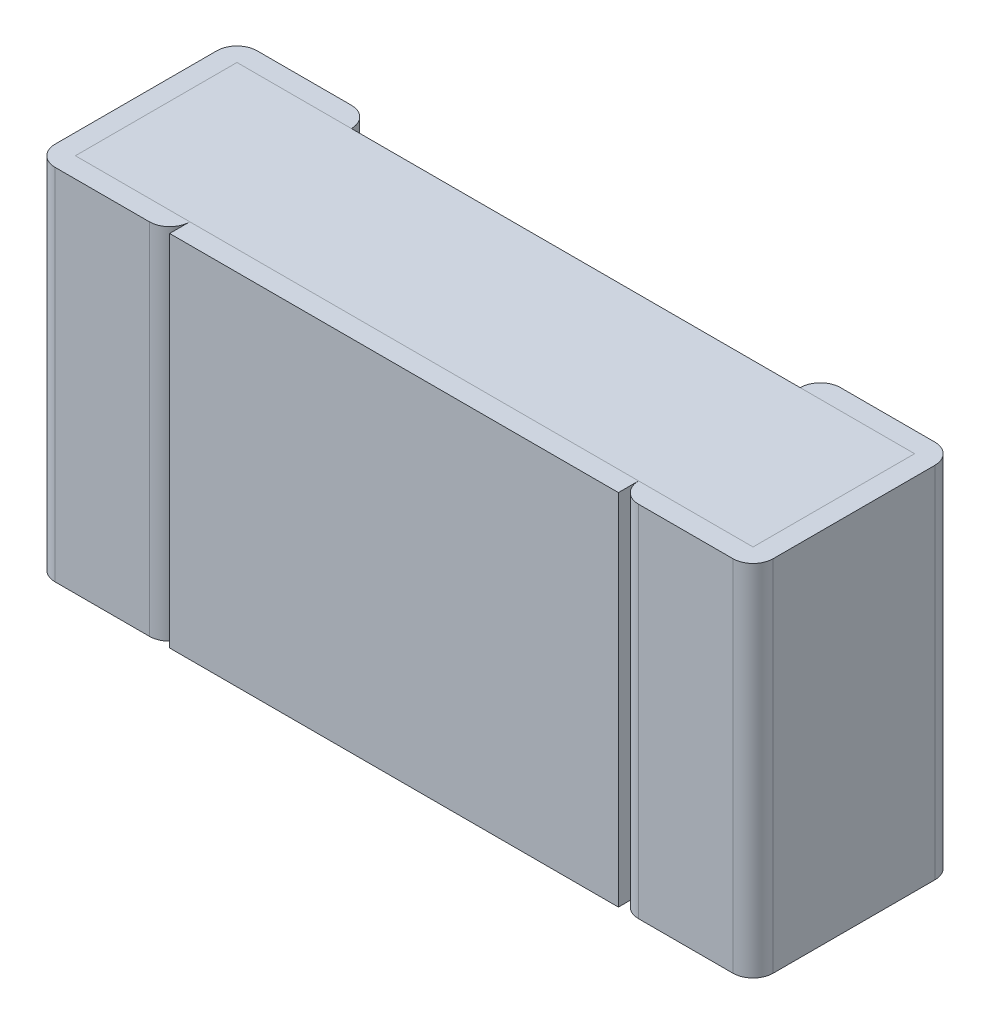
ISO-10303-21;
HEADER;
FILE_DESCRIPTION(('STEP AP214'),'2;1');
FILE_NAME('part.step','',(''),(''),'','','');
FILE_SCHEMA(('AUTOMOTIVE_DESIGN { 1 0 10303 214 1 1 1 1 }'));
ENDSEC;
DATA;
#1=APPLICATION_CONTEXT('core data for automotive mechanical design processes');
#2=APPLICATION_PROTOCOL_DEFINITION('international standard','automotive_design',2000,#1);
#3=PRODUCT_CONTEXT('',#1,'mechanical');
#4=PRODUCT('Part','Part','',(#3));
#5=PRODUCT_RELATED_PRODUCT_CATEGORY('part','',(#4));
#6=PRODUCT_DEFINITION_FORMATION('','',#4);
#7=PRODUCT_DEFINITION_CONTEXT('part definition',#1,'design');
#8=PRODUCT_DEFINITION('design','',#6,#7);
#9=PRODUCT_DEFINITION_SHAPE('','',#8);
#10=(LENGTH_UNIT() NAMED_UNIT(*) SI_UNIT(.MILLI.,.METRE.));
#11=(NAMED_UNIT(*) PLANE_ANGLE_UNIT() SI_UNIT($,.RADIAN.));
#12=(NAMED_UNIT(*) SI_UNIT($,.STERADIAN.) SOLID_ANGLE_UNIT());
#13=UNCERTAINTY_MEASURE_WITH_UNIT(LENGTH_MEASURE(1.E-05),#10,'distance_accuracy_value','');
#14=(GEOMETRIC_REPRESENTATION_CONTEXT(3) GLOBAL_UNCERTAINTY_ASSIGNED_CONTEXT((#13)) GLOBAL_UNIT_ASSIGNED_CONTEXT((#10,
#11,#12)) REPRESENTATION_CONTEXT('',''));
#15=CARTESIAN_POINT('',(0.,0.,0.));
#16=DIRECTION('',(0.,0.,1.));
#17=DIRECTION('',(1.,0.,0.));
#18=AXIS2_PLACEMENT_3D('',#15,#16,#17);
#19=CARTESIAN_POINT('',(-0.5,-0.4,0.45));
#20=DIRECTION('',(0.,0.,1.));
#21=DIRECTION('',(1.,0.,0.));
#22=AXIS2_PLACEMENT_3D('',#19,#20,#21);
#23=PLANE('',#22);
#24=DIRECTION('',(0.,1.,0.));
#25=VECTOR('',#24,1.);
#26=CARTESIAN_POINT('',(-0.5,-0.4,0.45));
#27=LINE('',#26,#25);
#28=CARTESIAN_POINT('',(-0.5,-0.4,0.45));
#29=VERTEX_POINT('',#28);
#30=CARTESIAN_POINT('',(-0.5,0.4,0.45));
#31=VERTEX_POINT('',#30);
#32=EDGE_CURVE('E313',#29,#31,#27,.T.);
#33=ORIENTED_EDGE('',*,*,#32,.F.);
#34=DIRECTION('',(1.,0.,0.));
#35=VECTOR('',#34,1.);
#36=CARTESIAN_POINT('',(-0.5,-0.4,0.45));
#37=LINE('',#36,#35);
#38=CARTESIAN_POINT('',(0.5,-0.4,0.45));
#39=VERTEX_POINT('',#38);
#40=EDGE_CURVE('E308',#29,#39,#37,.T.);
#41=ORIENTED_EDGE('',*,*,#40,.T.);
#42=DIRECTION('',(0.,1.,0.));
#43=VECTOR('',#42,1.);
#44=CARTESIAN_POINT('',(0.5,-0.4,0.45));
#45=LINE('',#44,#43);
#46=CARTESIAN_POINT('',(0.5,0.4,0.45));
#47=VERTEX_POINT('',#46);
#48=EDGE_CURVE('E10',#39,#47,#45,.T.);
#49=ORIENTED_EDGE('',*,*,#48,.T.);
#50=DIRECTION('',(1.,0.,0.));
#51=VECTOR('',#50,1.);
#52=CARTESIAN_POINT('',(-0.5,0.4,0.45));
#53=LINE('',#52,#51);
#54=EDGE_CURVE('E241',#31,#47,#53,.T.);
#55=ORIENTED_EDGE('',*,*,#54,.F.);
#56=EDGE_LOOP('',(#33,#41,#49,#55));
#57=FACE_BOUND('',#56,.T.);
#58=ADVANCED_FACE('F16',(#57),#23,.T.);
#59=CARTESIAN_POINT('',(0.5,-0.4,0.405));
#60=DIRECTION('',(1.,0.,0.));
#61=DIRECTION('',(0.,1.,0.));
#62=AXIS2_PLACEMENT_3D('',#59,#60,#61);
#63=PLANE('',#62);
#64=DIRECTION('',(0.,0.,1.));
#65=VECTOR('',#64,1.);
#66=CARTESIAN_POINT('',(0.5,-0.4,0.405));
#67=LINE('',#66,#65);
#68=CARTESIAN_POINT('',(0.5,-0.4,0.405));
#69=VERTEX_POINT('',#68);
#70=EDGE_CURVE('E304',#69,#39,#67,.T.);
#71=ORIENTED_EDGE('',*,*,#70,.F.);
#72=DIRECTION('',(0.,1.,0.));
#73=VECTOR('',#72,1.);
#74=CARTESIAN_POINT('',(0.5,-0.4,0.405));
#75=LINE('',#74,#73);
#76=CARTESIAN_POINT('',(0.5,0.4,0.405));
#77=VERTEX_POINT('',#76);
#78=EDGE_CURVE('E27',#69,#77,#75,.T.);
#79=ORIENTED_EDGE('',*,*,#78,.T.);
#80=DIRECTION('',(0.,0.,1.));
#81=VECTOR('',#80,1.);
#82=CARTESIAN_POINT('',(0.5,0.4,0.405));
#83=LINE('',#82,#81);
#84=EDGE_CURVE('E245',#77,#47,#83,.T.);
#85=ORIENTED_EDGE('',*,*,#84,.T.);
#86=ORIENTED_EDGE('',*,*,#48,.F.);
#87=EDGE_LOOP('',(#71,#79,#85,#86));
#88=FACE_BOUND('',#87,.T.);
#89=ADVANCED_FACE('F501',(#88),#63,.T.);
#90=CARTESIAN_POINT('',(0.545,-0.4,0.405));
#91=DIRECTION('',(0.,1.,0.));
#92=DIRECTION('',(-1.,0.,0.));
#93=AXIS2_PLACEMENT_3D('',#90,#91,#92);
#94=CYLINDRICAL_SURFACE('',#93,0.045);
#95=CARTESIAN_POINT('',(0.545,-0.4,0.405));
#96=DIRECTION('',(0.,1.,0.));
#97=DIRECTION('',(0.,0.,1.));
#98=AXIS2_PLACEMENT_3D('',#95,#96,#97);
#99=CIRCLE('',#98,0.045);
#100=CARTESIAN_POINT('',(0.545,-0.4,0.45));
#101=VERTEX_POINT('',#100);
#102=EDGE_CURVE('E265',#69,#101,#99,.T.);
#103=ORIENTED_EDGE('',*,*,#102,.T.);
#104=DIRECTION('',(0.,1.,0.));
#105=VECTOR('',#104,1.);
#106=CARTESIAN_POINT('',(0.545,-0.4,0.45));
#107=LINE('',#106,#105);
#108=CARTESIAN_POINT('',(0.545,0.4,0.45));
#109=VERTEX_POINT('',#108);
#110=EDGE_CURVE('E341',#101,#109,#107,.T.);
#111=ORIENTED_EDGE('',*,*,#110,.T.);
#112=CARTESIAN_POINT('',(0.545,0.4,0.405));
#113=DIRECTION('',(0.,1.,0.));
#114=DIRECTION('',(0.,0.,1.));
#115=AXIS2_PLACEMENT_3D('',#112,#113,#114);
#116=CIRCLE('',#115,0.045);
#117=EDGE_CURVE('E228',#77,#109,#116,.T.);
#118=ORIENTED_EDGE('',*,*,#117,.F.);
#119=ORIENTED_EDGE('',*,*,#78,.F.);
#120=EDGE_LOOP('',(#103,#111,#118,#119));
#121=FACE_BOUND('',#120,.T.);
#122=ADVANCED_FACE('F510',(#121),#94,.T.);
#123=CARTESIAN_POINT('',(0.5,-0.4,0.45));
#124=DIRECTION('',(0.,0.,1.));
#125=DIRECTION('',(1.,0.,0.));
#126=AXIS2_PLACEMENT_3D('',#123,#124,#125);
#127=PLANE('',#126);
#128=DIRECTION('',(1.,0.,0.));
#129=VECTOR('',#128,1.);
#130=CARTESIAN_POINT('',(0.5,0.4,0.45));
#131=LINE('',#130,#129);
#132=CARTESIAN_POINT('',(0.755,0.4,0.45));
#133=VERTEX_POINT('',#132);
#134=EDGE_CURVE('E232',#109,#133,#131,.T.);
#135=ORIENTED_EDGE('',*,*,#134,.F.);
#136=ORIENTED_EDGE('',*,*,#110,.F.);
#137=DIRECTION('',(1.,0.,0.));
#138=VECTOR('',#137,1.);
#139=CARTESIAN_POINT('',(0.5,-0.4,0.45));
#140=LINE('',#139,#138);
#141=CARTESIAN_POINT('',(0.755,-0.4,0.45));
#142=VERTEX_POINT('',#141);
#143=EDGE_CURVE('E270',#101,#142,#140,.T.);
#144=ORIENTED_EDGE('',*,*,#143,.T.);
#145=DIRECTION('',(0.,1.,0.));
#146=VECTOR('',#145,1.);
#147=CARTESIAN_POINT('',(0.755,-0.4,0.45));
#148=LINE('',#147,#146);
#149=EDGE_CURVE('E344',#142,#133,#148,.T.);
#150=ORIENTED_EDGE('',*,*,#149,.T.);
#151=EDGE_LOOP('',(#135,#136,#144,#150));
#152=FACE_BOUND('',#151,.T.);
#153=ADVANCED_FACE('F619',(#152),#127,.T.);
#154=CARTESIAN_POINT('',(0.755,-0.4,0.405));
#155=DIRECTION('',(0.,1.,0.));
#156=DIRECTION('',(1.,0.,0.));
#157=AXIS2_PLACEMENT_3D('',#154,#155,#156);
#158=CYLINDRICAL_SURFACE('',#157,0.045);
#159=DIRECTION('',(0.,1.,0.));
#160=VECTOR('',#159,1.);
#161=CARTESIAN_POINT('',(0.8,-0.4,0.405));
#162=LINE('',#161,#160);
#163=CARTESIAN_POINT('',(0.8,-0.4,0.405));
#164=VERTEX_POINT('',#163);
#165=CARTESIAN_POINT('',(0.8,0.4,0.405));
#166=VERTEX_POINT('',#165);
#167=EDGE_CURVE('E380',#164,#166,#162,.T.);
#168=ORIENTED_EDGE('',*,*,#167,.T.);
#169=CARTESIAN_POINT('',(0.755,0.4,0.405));
#170=DIRECTION('',(0.,-1.,0.));
#171=DIRECTION('',(0.,0.,1.));
#172=AXIS2_PLACEMENT_3D('',#169,#170,#171);
#173=CIRCLE('',#172,0.045);
#174=EDGE_CURVE('E322',#166,#133,#173,.T.);
#175=ORIENTED_EDGE('',*,*,#174,.T.);
#176=ORIENTED_EDGE('',*,*,#149,.F.);
#177=CARTESIAN_POINT('',(0.755,-0.4,0.405));
#178=DIRECTION('',(0.,-1.,0.));
#179=DIRECTION('',(0.,0.,1.));
#180=AXIS2_PLACEMENT_3D('',#177,#178,#179);
#181=CIRCLE('',#180,0.045);
#182=EDGE_CURVE('E301',#164,#142,#181,.T.);
#183=ORIENTED_EDGE('',*,*,#182,.F.);
#184=EDGE_LOOP('',(#168,#175,#176,#183));
#185=FACE_BOUND('',#184,.T.);
#186=ADVANCED_FACE('F614',(#185),#158,.T.);
#187=CARTESIAN_POINT('',(0.8,-0.4,0.));
#188=DIRECTION('',(1.,0.,0.));
#189=DIRECTION('',(0.,1.,0.));
#190=AXIS2_PLACEMENT_3D('',#187,#188,#189);
#191=PLANE('',#190);
#192=DIRECTION('',(0.,0.,1.));
#193=VECTOR('',#192,1.);
#194=CARTESIAN_POINT('',(0.8,-0.4,0.));
#195=LINE('',#194,#193);
#196=CARTESIAN_POINT('',(0.8,-0.4,0.045));
#197=VERTEX_POINT('',#196);
#198=EDGE_CURVE('E258',#197,#164,#195,.T.);
#199=ORIENTED_EDGE('',*,*,#198,.F.);
#200=DIRECTION('',(0.,1.,0.));
#201=VECTOR('',#200,1.);
#202=CARTESIAN_POINT('',(0.8,-0.4,0.045));
#203=LINE('',#202,#201);
#204=CARTESIAN_POINT('',(0.8,0.4,0.045));
#205=VERTEX_POINT('',#204);
#206=EDGE_CURVE('E196',#197,#205,#203,.T.);
#207=ORIENTED_EDGE('',*,*,#206,.T.);
#208=DIRECTION('',(0.,0.,1.));
#209=VECTOR('',#208,1.);
#210=CARTESIAN_POINT('',(0.8,0.4,0.));
#211=LINE('',#210,#209);
#212=EDGE_CURVE('E318',#205,#166,#211,.T.);
#213=ORIENTED_EDGE('',*,*,#212,.T.);
#214=ORIENTED_EDGE('',*,*,#167,.F.);
#215=EDGE_LOOP('',(#199,#207,#213,#214));
#216=FACE_BOUND('',#215,.T.);
#217=ADVANCED_FACE('F18',(#216),#191,.T.);
#218=CARTESIAN_POINT('',(0.755,-0.4,0.045));
#219=DIRECTION('',(0.,1.,0.));
#220=DIRECTION('',(1.,0.,0.));
#221=AXIS2_PLACEMENT_3D('',#218,#219,#220);
#222=CYLINDRICAL_SURFACE('',#221,0.045);
#223=CARTESIAN_POINT('',(0.755,-0.4,0.045));
#224=DIRECTION('',(0.,1.,0.));
#225=DIRECTION('',(0.,0.,1.));
#226=AXIS2_PLACEMENT_3D('',#223,#224,#225);
#227=CIRCLE('',#226,0.045);
#228=CARTESIAN_POINT('',(0.755,-0.4,0.));
#229=VERTEX_POINT('',#228);
#230=EDGE_CURVE('E254',#197,#229,#227,.T.);
#231=ORIENTED_EDGE('',*,*,#230,.T.);
#232=DIRECTION('',(0.,1.,0.));
#233=VECTOR('',#232,1.);
#234=CARTESIAN_POINT('',(0.755,-0.4,0.));
#235=LINE('',#234,#233);
#236=CARTESIAN_POINT('',(0.755,0.4,0.));
#237=VERTEX_POINT('',#236);
#238=EDGE_CURVE('E377',#229,#237,#235,.T.);
#239=ORIENTED_EDGE('',*,*,#238,.T.);
#240=CARTESIAN_POINT('',(0.755,0.4,0.045));
#241=DIRECTION('',(0.,1.,0.));
#242=DIRECTION('',(0.,0.,1.));
#243=AXIS2_PLACEMENT_3D('',#240,#241,#242);
#244=CIRCLE('',#243,0.045);
#245=EDGE_CURVE('E246',#205,#237,#244,.T.);
#246=ORIENTED_EDGE('',*,*,#245,.F.);
#247=ORIENTED_EDGE('',*,*,#206,.F.);
#248=EDGE_LOOP('',(#231,#239,#246,#247));
#249=FACE_BOUND('',#248,.T.);
#250=ADVANCED_FACE('F594',(#249),#222,.T.);
#251=CARTESIAN_POINT('',(0.5,-0.4,0.));
#252=DIRECTION('',(0.,0.,1.));
#253=DIRECTION('',(1.,0.,0.));
#254=AXIS2_PLACEMENT_3D('',#251,#252,#253);
#255=PLANE('',#254);
#256=ORIENTED_EDGE('',*,*,#238,.F.);
#257=DIRECTION('',(1.,0.,0.));
#258=VECTOR('',#257,1.);
#259=CARTESIAN_POINT('',(0.5,-0.4,0.));
#260=LINE('',#259,#258);
#261=CARTESIAN_POINT('',(0.545,-0.4,0.));
#262=VERTEX_POINT('',#261);
#263=EDGE_CURVE('E309',#262,#229,#260,.T.);
#264=ORIENTED_EDGE('',*,*,#263,.F.);
#265=DIRECTION('',(0.,1.,0.));
#266=VECTOR('',#265,1.);
#267=CARTESIAN_POINT('',(0.545,-0.4,0.));
#268=LINE('',#267,#266);
#269=CARTESIAN_POINT('',(0.545,0.4,0.));
#270=VERTEX_POINT('',#269);
#271=EDGE_CURVE('E363',#262,#270,#268,.T.);
#272=ORIENTED_EDGE('',*,*,#271,.T.);
#273=DIRECTION('',(1.,0.,0.));
#274=VECTOR('',#273,1.);
#275=CARTESIAN_POINT('',(0.5,0.4,0.));
#276=LINE('',#275,#274);
#277=EDGE_CURVE('E249',#270,#237,#276,.T.);
#278=ORIENTED_EDGE('',*,*,#277,.T.);
#279=EDGE_LOOP('',(#256,#264,#272,#278));
#280=FACE_BOUND('',#279,.T.);
#281=ADVANCED_FACE('F586',(#280),#255,.F.);
#282=CARTESIAN_POINT('',(0.545,-0.4,0.045));
#283=DIRECTION('',(0.,1.,0.));
#284=DIRECTION('',(-1.,0.,0.));
#285=AXIS2_PLACEMENT_3D('',#282,#283,#284);
#286=CYLINDRICAL_SURFACE('',#285,0.045);
#287=DIRECTION('',(0.,1.,0.));
#288=VECTOR('',#287,1.);
#289=CARTESIAN_POINT('',(0.5,-0.4,0.045));
#290=LINE('',#289,#288);
#291=CARTESIAN_POINT('',(0.5,-0.4,0.045));
#292=VERTEX_POINT('',#291);
#293=CARTESIAN_POINT('',(0.5,0.4,0.045));
#294=VERTEX_POINT('',#293);
#295=EDGE_CURVE('E226',#292,#294,#290,.T.);
#296=ORIENTED_EDGE('',*,*,#295,.T.);
#297=CARTESIAN_POINT('',(0.545,0.4,0.045));
#298=DIRECTION('',(0.,-1.,0.));
#299=DIRECTION('',(0.,0.,1.));
#300=AXIS2_PLACEMENT_3D('',#297,#298,#299);
#301=CIRCLE('',#300,0.045);
#302=EDGE_CURVE('E233',#294,#270,#301,.T.);
#303=ORIENTED_EDGE('',*,*,#302,.T.);
#304=ORIENTED_EDGE('',*,*,#271,.F.);
#305=CARTESIAN_POINT('',(0.545,-0.4,0.045));
#306=DIRECTION('',(0.,-1.,0.));
#307=DIRECTION('',(0.,0.,1.));
#308=AXIS2_PLACEMENT_3D('',#305,#306,#307);
#309=CIRCLE('',#308,0.045);
#310=EDGE_CURVE('E269',#292,#262,#309,.T.);
#311=ORIENTED_EDGE('',*,*,#310,.F.);
#312=EDGE_LOOP('',(#296,#303,#304,#311));
#313=FACE_BOUND('',#312,.T.);
#314=ADVANCED_FACE('F581',(#313),#286,.T.);
#315=CARTESIAN_POINT('',(-0.5,0.4,0.405));
#316=DIRECTION('',(0.,1.,0.));
#317=DIRECTION('',(1.,0.,0.));
#318=AXIS2_PLACEMENT_3D('',#315,#316,#317);
#319=PLANE('',#318);
#320=DIRECTION('',(1.,0.,0.));
#321=VECTOR('',#320,1.);
#322=CARTESIAN_POINT('',(-0.5,0.4,0.405));
#323=LINE('',#322,#321);
#324=CARTESIAN_POINT('',(-0.5,0.4,0.405));
#325=VERTEX_POINT('',#324);
#326=EDGE_CURVE('E20',#325,#77,#323,.T.);
#327=ORIENTED_EDGE('',*,*,#326,.F.);
#328=DIRECTION('',(0.,0.,1.));
#329=VECTOR('',#328,1.);
#330=CARTESIAN_POINT('',(-0.5,0.4,0.405));
#331=LINE('',#330,#329);
#332=EDGE_CURVE('E253',#325,#31,#331,.T.);
#333=ORIENTED_EDGE('',*,*,#332,.T.);
#334=ORIENTED_EDGE('',*,*,#54,.T.);
#335=ORIENTED_EDGE('',*,*,#84,.F.);
#336=EDGE_LOOP('',(#327,#333,#334,#335));
#337=FACE_BOUND('',#336,.T.);
#338=ADVANCED_FACE('F507',(#337),#319,.T.);
#339=CARTESIAN_POINT('',(0.5,0.4,0.));
#340=DIRECTION('',(0.,1.,0.));
#341=DIRECTION('',(1.,0.,0.));
#342=AXIS2_PLACEMENT_3D('',#339,#340,#341);
#343=PLANE('',#342);
#344=ORIENTED_EDGE('',*,*,#277,.F.);
#345=ORIENTED_EDGE('',*,*,#302,.F.);
#346=DIRECTION('',(1.,0.,0.));
#347=VECTOR('',#346,1.);
#348=CARTESIAN_POINT('',(-0.755,0.4,0.045));
#349=LINE('',#348,#347);
#350=CARTESIAN_POINT('',(0.755,0.4,0.045));
#351=VERTEX_POINT('',#350);
#352=EDGE_CURVE('E227',#294,#351,#349,.T.);
#353=ORIENTED_EDGE('',*,*,#352,.T.);
#354=DIRECTION('',(0.,0.,1.));
#355=VECTOR('',#354,1.);
#356=CARTESIAN_POINT('',(0.755,0.4,0.045));
#357=LINE('',#356,#355);
#358=CARTESIAN_POINT('',(0.755,0.4,0.405));
#359=VERTEX_POINT('',#358);
#360=EDGE_CURVE('E330',#351,#359,#357,.T.);
#361=ORIENTED_EDGE('',*,*,#360,.T.);
#362=DIRECTION('',(1.,0.,0.));
#363=VECTOR('',#362,1.);
#364=CARTESIAN_POINT('',(-0.755,0.4,0.405));
#365=LINE('',#364,#363);
#366=EDGE_CURVE('E326',#77,#359,#365,.T.);
#367=ORIENTED_EDGE('',*,*,#366,.F.);
#368=ORIENTED_EDGE('',*,*,#117,.T.);
#369=ORIENTED_EDGE('',*,*,#134,.T.);
#370=ORIENTED_EDGE('',*,*,#174,.F.);
#371=ORIENTED_EDGE('',*,*,#212,.F.);
#372=ORIENTED_EDGE('',*,*,#245,.T.);
#373=EDGE_LOOP('',(#344,#345,#353,#361,#367,#368,#369,#370,#371,#372));
#374=FACE_BOUND('',#373,.T.);
#375=ADVANCED_FACE('F514',(#374),#343,.T.);
#376=CARTESIAN_POINT('',(-0.5,-0.4,0.405));
#377=DIRECTION('',(1.,0.,0.));
#378=DIRECTION('',(0.,1.,0.));
#379=AXIS2_PLACEMENT_3D('',#376,#377,#378);
#380=PLANE('',#379);
#381=ORIENTED_EDGE('',*,*,#32,.T.);
#382=ORIENTED_EDGE('',*,*,#332,.F.);
#383=DIRECTION('',(0.,1.,0.));
#384=VECTOR('',#383,1.);
#385=CARTESIAN_POINT('',(-0.5,-0.4,0.405));
#386=LINE('',#385,#384);
#387=CARTESIAN_POINT('',(-0.5,-0.4,0.405));
#388=VERTEX_POINT('',#387);
#389=EDGE_CURVE('E166',#388,#325,#386,.T.);
#390=ORIENTED_EDGE('',*,*,#389,.F.);
#391=DIRECTION('',(0.,0.,1.));
#392=VECTOR('',#391,1.);
#393=CARTESIAN_POINT('',(-0.5,-0.4,0.405));
#394=LINE('',#393,#392);
#395=EDGE_CURVE('E317',#388,#29,#394,.T.);
#396=ORIENTED_EDGE('',*,*,#395,.T.);
#397=EDGE_LOOP('',(#381,#382,#390,#396));
#398=FACE_BOUND('',#397,.T.);
#399=ADVANCED_FACE('F683',(#398),#380,.F.);
#400=CARTESIAN_POINT('',(-0.5,-0.4,0.405));
#401=DIRECTION('',(0.,1.,0.));
#402=DIRECTION('',(1.,0.,0.));
#403=AXIS2_PLACEMENT_3D('',#400,#401,#402);
#404=PLANE('',#403);
#405=ORIENTED_EDGE('',*,*,#70,.T.);
#406=ORIENTED_EDGE('',*,*,#40,.F.);
#407=ORIENTED_EDGE('',*,*,#395,.F.);
#408=DIRECTION('',(1.,0.,0.));
#409=VECTOR('',#408,1.);
#410=CARTESIAN_POINT('',(-0.5,-0.4,0.405));
#411=LINE('',#410,#409);
#412=EDGE_CURVE('E167',#388,#69,#411,.T.);
#413=ORIENTED_EDGE('',*,*,#412,.T.);
#414=EDGE_LOOP('',(#405,#406,#407,#413));
#415=FACE_BOUND('',#414,.T.);
#416=ADVANCED_FACE('F688',(#415),#404,.F.);
#417=CARTESIAN_POINT('',(0.5,-0.4,0.));
#418=DIRECTION('',(0.,1.,0.));
#419=DIRECTION('',(1.,0.,0.));
#420=AXIS2_PLACEMENT_3D('',#417,#418,#419);
#421=PLANE('',#420);
#422=ORIENTED_EDGE('',*,*,#230,.F.);
#423=ORIENTED_EDGE('',*,*,#198,.T.);
#424=ORIENTED_EDGE('',*,*,#182,.T.);
#425=ORIENTED_EDGE('',*,*,#143,.F.);
#426=ORIENTED_EDGE('',*,*,#102,.F.);
#427=DIRECTION('',(1.,0.,0.));
#428=VECTOR('',#427,1.);
#429=CARTESIAN_POINT('',(-0.755,-0.4,0.405));
#430=LINE('',#429,#428);
#431=CARTESIAN_POINT('',(0.755,-0.4,0.405));
#432=VERTEX_POINT('',#431);
#433=EDGE_CURVE('E334',#69,#432,#430,.T.);
#434=ORIENTED_EDGE('',*,*,#433,.T.);
#435=DIRECTION('',(0.,0.,1.));
#436=VECTOR('',#435,1.);
#437=CARTESIAN_POINT('',(0.755,-0.4,0.045));
#438=LINE('',#437,#436);
#439=CARTESIAN_POINT('',(0.755,-0.4,0.045));
#440=VERTEX_POINT('',#439);
#441=EDGE_CURVE('E278',#440,#432,#438,.T.);
#442=ORIENTED_EDGE('',*,*,#441,.F.);
#443=DIRECTION('',(1.,0.,0.));
#444=VECTOR('',#443,1.);
#445=CARTESIAN_POINT('',(-0.755,-0.4,0.045));
#446=LINE('',#445,#444);
#447=EDGE_CURVE('E275',#292,#440,#446,.T.);
#448=ORIENTED_EDGE('',*,*,#447,.F.);
#449=ORIENTED_EDGE('',*,*,#310,.T.);
#450=ORIENTED_EDGE('',*,*,#263,.T.);
#451=EDGE_LOOP('',(#422,#423,#424,#425,#426,#434,#442,#448,#449,#450));
#452=FACE_BOUND('',#451,.T.);
#453=ADVANCED_FACE('F608',(#452),#421,.F.);
#454=CARTESIAN_POINT('',(-0.755,-0.4,0.045));
#455=DIRECTION('',(0.,0.,1.));
#456=DIRECTION('',(1.,0.,0.));
#457=AXIS2_PLACEMENT_3D('',#454,#455,#456);
#458=PLANE('',#457);
#459=DIRECTION('',(1.,0.,0.));
#460=VECTOR('',#459,1.);
#461=CARTESIAN_POINT('',(-0.755,0.4,0.045));
#462=LINE('',#461,#460);
#463=CARTESIAN_POINT('',(-0.5,0.4,0.045));
#464=VERTEX_POINT('',#463);
#465=EDGE_CURVE('E222',#464,#294,#462,.T.);
#466=ORIENTED_EDGE('',*,*,#465,.T.);
#467=ORIENTED_EDGE('',*,*,#295,.F.);
#468=DIRECTION('',(1.,0.,0.));
#469=VECTOR('',#468,1.);
#470=CARTESIAN_POINT('',(-0.755,-0.4,0.045));
#471=LINE('',#470,#469);
#472=CARTESIAN_POINT('',(-0.5,-0.4,0.045));
#473=VERTEX_POINT('',#472);
#474=EDGE_CURVE('E279',#473,#292,#471,.T.);
#475=ORIENTED_EDGE('',*,*,#474,.F.);
#476=DIRECTION('',(0.,1.,0.));
#477=VECTOR('',#476,1.);
#478=CARTESIAN_POINT('',(-0.5,-0.4,0.045));
#479=LINE('',#478,#477);
#480=EDGE_CURVE('E299',#473,#464,#479,.T.);
#481=ORIENTED_EDGE('',*,*,#480,.T.);
#482=EDGE_LOOP('',(#466,#467,#475,#481));
#483=FACE_BOUND('',#482,.T.);
#484=ADVANCED_FACE('F535',(#483),#458,.F.);
#485=CARTESIAN_POINT('',(-0.755,0.4,0.045));
#486=DIRECTION('',(0.,1.,0.));
#487=DIRECTION('',(1.,0.,0.));
#488=AXIS2_PLACEMENT_3D('',#485,#486,#487);
#489=PLANE('',#488);
#490=DIRECTION('',(1.,0.,0.));
#491=VECTOR('',#490,1.);
#492=CARTESIAN_POINT('',(-0.755,0.4,0.045));
#493=LINE('',#492,#491);
#494=CARTESIAN_POINT('',(-0.755,0.4,0.045));
#495=VERTEX_POINT('',#494);
#496=EDGE_CURVE('E274',#495,#464,#493,.T.);
#497=ORIENTED_EDGE('',*,*,#496,.F.);
#498=DIRECTION('',(0.,0.,1.));
#499=VECTOR('',#498,1.);
#500=CARTESIAN_POINT('',(-0.755,0.4,0.045));
#501=LINE('',#500,#499);
#502=CARTESIAN_POINT('',(-0.755,0.4,0.405));
#503=VERTEX_POINT('',#502);
#504=EDGE_CURVE('E218',#495,#503,#501,.T.);
#505=ORIENTED_EDGE('',*,*,#504,.T.);
#506=DIRECTION('',(1.,0.,0.));
#507=VECTOR('',#506,1.);
#508=CARTESIAN_POINT('',(-0.755,0.4,0.405));
#509=LINE('',#508,#507);
#510=EDGE_CURVE('E177',#503,#325,#509,.T.);
#511=ORIENTED_EDGE('',*,*,#510,.T.);
#512=ORIENTED_EDGE('',*,*,#326,.T.);
#513=ORIENTED_EDGE('',*,*,#366,.T.);
#514=ORIENTED_EDGE('',*,*,#360,.F.);
#515=ORIENTED_EDGE('',*,*,#352,.F.);
#516=ORIENTED_EDGE('',*,*,#465,.F.);
#517=EDGE_LOOP('',(#497,#505,#511,#512,#513,#514,#515,#516));
#518=FACE_BOUND('',#517,.T.);
#519=ADVANCED_FACE('F407',(#518),#489,.T.);
#520=CARTESIAN_POINT('',(-0.545,-0.4,0.405));
#521=DIRECTION('',(0.,1.,0.));
#522=DIRECTION('',(1.,0.,0.));
#523=AXIS2_PLACEMENT_3D('',#520,#521,#522);
#524=CYLINDRICAL_SURFACE('',#523,0.045);
#525=ORIENTED_EDGE('',*,*,#389,.T.);
#526=CARTESIAN_POINT('',(-0.545,0.4,0.405));
#527=DIRECTION('',(0.,-1.,0.));
#528=DIRECTION('',(0.,0.,1.));
#529=AXIS2_PLACEMENT_3D('',#526,#527,#528);
#530=CIRCLE('',#529,0.045);
#531=CARTESIAN_POINT('',(-0.545,0.4,0.45));
#532=VERTEX_POINT('',#531);
#533=EDGE_CURVE('E170',#325,#532,#530,.T.);
#534=ORIENTED_EDGE('',*,*,#533,.T.);
#535=DIRECTION('',(0.,1.,0.));
#536=VECTOR('',#535,1.);
#537=CARTESIAN_POINT('',(-0.545,-0.4,0.45));
#538=LINE('',#537,#536);
#539=CARTESIAN_POINT('',(-0.545,-0.4,0.45));
#540=VERTEX_POINT('',#539);
#541=EDGE_CURVE('E154',#540,#532,#538,.T.);
#542=ORIENTED_EDGE('',*,*,#541,.F.);
#543=CARTESIAN_POINT('',(-0.545,-0.4,0.405));
#544=DIRECTION('',(0.,-1.,0.));
#545=DIRECTION('',(0.,0.,1.));
#546=AXIS2_PLACEMENT_3D('',#543,#544,#545);
#547=CIRCLE('',#546,0.045);
#548=EDGE_CURVE('E290',#388,#540,#547,.T.);
#549=ORIENTED_EDGE('',*,*,#548,.F.);
#550=EDGE_LOOP('',(#525,#534,#542,#549));
#551=FACE_BOUND('',#550,.T.);
#552=ADVANCED_FACE('F171',(#551),#524,.T.);
#553=CARTESIAN_POINT('',(-0.8,-0.4,0.45));
#554=DIRECTION('',(0.,0.,1.));
#555=DIRECTION('',(1.,0.,0.));
#556=AXIS2_PLACEMENT_3D('',#553,#554,#555);
#557=PLANE('',#556);
#558=DIRECTION('',(1.,0.,0.));
#559=VECTOR('',#558,1.);
#560=CARTESIAN_POINT('',(-0.8,0.4,0.45));
#561=LINE('',#560,#559);
#562=CARTESIAN_POINT('',(-0.755,0.4,0.45));
#563=VERTEX_POINT('',#562);
#564=EDGE_CURVE('E158',#563,#532,#561,.T.);
#565=ORIENTED_EDGE('',*,*,#564,.F.);
#566=DIRECTION('',(0.,1.,0.));
#567=VECTOR('',#566,1.);
#568=CARTESIAN_POINT('',(-0.755,-0.4,0.45));
#569=LINE('',#568,#567);
#570=CARTESIAN_POINT('',(-0.755,-0.4,0.45));
#571=VERTEX_POINT('',#570);
#572=EDGE_CURVE('E199',#571,#563,#569,.T.);
#573=ORIENTED_EDGE('',*,*,#572,.F.);
#574=DIRECTION('',(1.,0.,0.));
#575=VECTOR('',#574,1.);
#576=CARTESIAN_POINT('',(-0.8,-0.4,0.45));
#577=LINE('',#576,#575);
#578=EDGE_CURVE('E161',#571,#540,#577,.T.);
#579=ORIENTED_EDGE('',*,*,#578,.T.);
#580=ORIENTED_EDGE('',*,*,#541,.T.);
#581=EDGE_LOOP('',(#565,#573,#579,#580));
#582=FACE_BOUND('',#581,.T.);
#583=ADVANCED_FACE('F156',(#582),#557,.T.);
#584=CARTESIAN_POINT('',(-0.755,-0.4,0.045));
#585=DIRECTION('',(0.,1.,0.));
#586=DIRECTION('',(1.,0.,0.));
#587=AXIS2_PLACEMENT_3D('',#584,#585,#586);
#588=PLANE('',#587);
#589=ORIENTED_EDGE('',*,*,#474,.T.);
#590=ORIENTED_EDGE('',*,*,#447,.T.);
#591=ORIENTED_EDGE('',*,*,#441,.T.);
#592=ORIENTED_EDGE('',*,*,#433,.F.);
#593=ORIENTED_EDGE('',*,*,#412,.F.);
#594=DIRECTION('',(1.,0.,0.));
#595=VECTOR('',#594,1.);
#596=CARTESIAN_POINT('',(-0.755,-0.4,0.405));
#597=LINE('',#596,#595);
#598=CARTESIAN_POINT('',(-0.755,-0.4,0.405));
#599=VERTEX_POINT('',#598);
#600=EDGE_CURVE('E283',#599,#388,#597,.T.);
#601=ORIENTED_EDGE('',*,*,#600,.F.);
#602=DIRECTION('',(0.,0.,1.));
#603=VECTOR('',#602,1.);
#604=CARTESIAN_POINT('',(-0.755,-0.4,0.045));
#605=LINE('',#604,#603);
#606=CARTESIAN_POINT('',(-0.755,-0.4,0.045));
#607=VERTEX_POINT('',#606);
#608=EDGE_CURVE('E263',#607,#599,#605,.T.);
#609=ORIENTED_EDGE('',*,*,#608,.F.);
#610=DIRECTION('',(1.,0.,0.));
#611=VECTOR('',#610,1.);
#612=CARTESIAN_POINT('',(-0.755,-0.4,0.045));
#613=LINE('',#612,#611);
#614=EDGE_CURVE('E259',#607,#473,#613,.T.);
#615=ORIENTED_EDGE('',*,*,#614,.T.);
#616=EDGE_LOOP('',(#589,#590,#591,#592,#593,#601,#609,#615));
#617=FACE_BOUND('',#616,.T.);
#618=ADVANCED_FACE('F459',(#617),#588,.F.);
#619=CARTESIAN_POINT('',(-0.545,-0.4,0.045));
#620=DIRECTION('',(0.,1.,0.));
#621=DIRECTION('',(1.,0.,0.));
#622=AXIS2_PLACEMENT_3D('',#619,#620,#621);
#623=CYLINDRICAL_SURFACE('',#622,0.045);
#624=CARTESIAN_POINT('',(-0.545,-0.4,0.045));
#625=DIRECTION('',(0.,1.,0.));
#626=DIRECTION('',(0.,0.,1.));
#627=AXIS2_PLACEMENT_3D('',#624,#625,#626);
#628=CIRCLE('',#627,0.045);
#629=CARTESIAN_POINT('',(-0.545,-0.4,0.));
#630=VERTEX_POINT('',#629);
#631=EDGE_CURVE('E264',#473,#630,#628,.T.);
#632=ORIENTED_EDGE('',*,*,#631,.T.);
#633=DIRECTION('',(0.,1.,0.));
#634=VECTOR('',#633,1.);
#635=CARTESIAN_POINT('',(-0.545,-0.4,0.));
#636=LINE('',#635,#634);
#637=CARTESIAN_POINT('',(-0.545,0.4,0.));
#638=VERTEX_POINT('',#637);
#639=EDGE_CURVE('E357',#630,#638,#636,.T.);
#640=ORIENTED_EDGE('',*,*,#639,.T.);
#641=CARTESIAN_POINT('',(-0.545,0.4,0.045));
#642=DIRECTION('',(0.,1.,0.));
#643=DIRECTION('',(0.,0.,1.));
#644=AXIS2_PLACEMENT_3D('',#641,#642,#643);
#645=CIRCLE('',#644,0.045);
#646=EDGE_CURVE('E360',#464,#638,#645,.T.);
#647=ORIENTED_EDGE('',*,*,#646,.F.);
#648=ORIENTED_EDGE('',*,*,#480,.F.);
#649=EDGE_LOOP('',(#632,#640,#647,#648));
#650=FACE_BOUND('',#649,.T.);
#651=ADVANCED_FACE('F466',(#650),#623,.T.);
#652=CARTESIAN_POINT('',(-0.8,-0.4,0.));
#653=DIRECTION('',(0.,0.,1.));
#654=DIRECTION('',(1.,0.,0.));
#655=AXIS2_PLACEMENT_3D('',#652,#653,#654);
#656=PLANE('',#655);
#657=ORIENTED_EDGE('',*,*,#639,.F.);
#658=DIRECTION('',(1.,0.,0.));
#659=VECTOR('',#658,1.);
#660=CARTESIAN_POINT('',(-0.8,-0.4,0.));
#661=LINE('',#660,#659);
#662=CARTESIAN_POINT('',(-0.755,-0.4,0.));
#663=VERTEX_POINT('',#662);
#664=EDGE_CURVE('E214',#663,#630,#661,.T.);
#665=ORIENTED_EDGE('',*,*,#664,.F.);
#666=DIRECTION('',(0.,1.,0.));
#667=VECTOR('',#666,1.);
#668=CARTESIAN_POINT('',(-0.755,-0.4,0.));
#669=LINE('',#668,#667);
#670=CARTESIAN_POINT('',(-0.755,0.4,0.));
#671=VERTEX_POINT('',#670);
#672=EDGE_CURVE('E236',#663,#671,#669,.T.);
#673=ORIENTED_EDGE('',*,*,#672,.T.);
#674=DIRECTION('',(1.,0.,0.));
#675=VECTOR('',#674,1.);
#676=CARTESIAN_POINT('',(-0.8,0.4,0.));
#677=LINE('',#676,#675);
#678=EDGE_CURVE('E186',#671,#638,#677,.T.);
#679=ORIENTED_EDGE('',*,*,#678,.T.);
#680=EDGE_LOOP('',(#657,#665,#673,#679));
#681=FACE_BOUND('',#680,.T.);
#682=ADVANCED_FACE('F561',(#681),#656,.F.);
#683=CARTESIAN_POINT('',(-0.8,0.4,0.));
#684=DIRECTION('',(0.,1.,0.));
#685=DIRECTION('',(1.,0.,0.));
#686=AXIS2_PLACEMENT_3D('',#683,#684,#685);
#687=PLANE('',#686);
#688=ORIENTED_EDGE('',*,*,#678,.F.);
#689=CARTESIAN_POINT('',(-0.755,0.4,0.045));
#690=DIRECTION('',(0.,-1.,0.));
#691=DIRECTION('',(0.,0.,1.));
#692=AXIS2_PLACEMENT_3D('',#689,#690,#691);
#693=CIRCLE('',#692,0.045);
#694=CARTESIAN_POINT('',(-0.8,0.4,0.045));
#695=VERTEX_POINT('',#694);
#696=EDGE_CURVE('E240',#695,#671,#693,.T.);
#697=ORIENTED_EDGE('',*,*,#696,.F.);
#698=DIRECTION('',(0.,0.,1.));
#699=VECTOR('',#698,1.);
#700=CARTESIAN_POINT('',(-0.8,0.4,0.));
#701=LINE('',#700,#699);
#702=CARTESIAN_POINT('',(-0.8,0.4,0.405));
#703=VERTEX_POINT('',#702);
#704=EDGE_CURVE('E205',#695,#703,#701,.T.);
#705=ORIENTED_EDGE('',*,*,#704,.T.);
#706=CARTESIAN_POINT('',(-0.755,0.4,0.405));
#707=DIRECTION('',(0.,1.,0.));
#708=DIRECTION('',(0.,0.,1.));
#709=AXIS2_PLACEMENT_3D('',#706,#707,#708);
#710=CIRCLE('',#709,0.045);
#711=EDGE_CURVE('E183',#703,#563,#710,.T.);
#712=ORIENTED_EDGE('',*,*,#711,.T.);
#713=ORIENTED_EDGE('',*,*,#564,.T.);
#714=ORIENTED_EDGE('',*,*,#533,.F.);
#715=ORIENTED_EDGE('',*,*,#510,.F.);
#716=ORIENTED_EDGE('',*,*,#504,.F.);
#717=ORIENTED_EDGE('',*,*,#496,.T.);
#718=ORIENTED_EDGE('',*,*,#646,.T.);
#719=EDGE_LOOP('',(#688,#697,#705,#712,#713,#714,#715,#716,#717,#718));
#720=FACE_BOUND('',#719,.T.);
#721=ADVANCED_FACE('F180',(#720),#687,.T.);
#722=CARTESIAN_POINT('',(-0.755,-0.4,0.405));
#723=DIRECTION('',(0.,1.,0.));
#724=DIRECTION('',(-1.,0.,0.));
#725=AXIS2_PLACEMENT_3D('',#722,#723,#724);
#726=CYLINDRICAL_SURFACE('',#725,0.045);
#727=CARTESIAN_POINT('',(-0.755,-0.4,0.405));
#728=DIRECTION('',(0.,1.,0.));
#729=DIRECTION('',(0.,0.,1.));
#730=AXIS2_PLACEMENT_3D('',#727,#728,#729);
#731=CIRCLE('',#730,0.045);
#732=CARTESIAN_POINT('',(-0.8,-0.4,0.405));
#733=VERTEX_POINT('',#732);
#734=EDGE_CURVE('E215',#733,#571,#731,.T.);
#735=ORIENTED_EDGE('',*,*,#734,.T.);
#736=ORIENTED_EDGE('',*,*,#572,.T.);
#737=ORIENTED_EDGE('',*,*,#711,.F.);
#738=DIRECTION('',(0.,1.,0.));
#739=VECTOR('',#738,1.);
#740=CARTESIAN_POINT('',(-0.8,-0.4,0.405));
#741=LINE('',#740,#739);
#742=EDGE_CURVE('E206',#733,#703,#741,.T.);
#743=ORIENTED_EDGE('',*,*,#742,.F.);
#744=EDGE_LOOP('',(#735,#736,#737,#743));
#745=FACE_BOUND('',#744,.T.);
#746=ADVANCED_FACE('F629',(#745),#726,.T.);
#747=CARTESIAN_POINT('',(-0.755,-0.4,0.045));
#748=DIRECTION('',(0.,1.,0.));
#749=DIRECTION('',(-1.,0.,0.));
#750=AXIS2_PLACEMENT_3D('',#747,#748,#749);
#751=CYLINDRICAL_SURFACE('',#750,0.045);
#752=DIRECTION('',(0.,1.,0.));
#753=VECTOR('',#752,1.);
#754=CARTESIAN_POINT('',(-0.8,-0.4,0.045));
#755=LINE('',#754,#753);
#756=CARTESIAN_POINT('',(-0.8,-0.4,0.045));
#757=VERTEX_POINT('',#756);
#758=EDGE_CURVE('E200',#757,#695,#755,.T.);
#759=ORIENTED_EDGE('',*,*,#758,.T.);
#760=ORIENTED_EDGE('',*,*,#696,.T.);
#761=ORIENTED_EDGE('',*,*,#672,.F.);
#762=CARTESIAN_POINT('',(-0.755,-0.4,0.045));
#763=DIRECTION('',(0.,-1.,0.));
#764=DIRECTION('',(0.,0.,1.));
#765=AXIS2_PLACEMENT_3D('',#762,#763,#764);
#766=CIRCLE('',#765,0.045);
#767=EDGE_CURVE('E210',#757,#663,#766,.T.);
#768=ORIENTED_EDGE('',*,*,#767,.F.);
#769=EDGE_LOOP('',(#759,#760,#761,#768));
#770=FACE_BOUND('',#769,.T.);
#771=ADVANCED_FACE('F554',(#770),#751,.T.);
#772=CARTESIAN_POINT('',(-0.8,-0.4,0.));
#773=DIRECTION('',(0.,1.,0.));
#774=DIRECTION('',(1.,0.,0.));
#775=AXIS2_PLACEMENT_3D('',#772,#773,#774);
#776=PLANE('',#775);
#777=ORIENTED_EDGE('',*,*,#631,.F.);
#778=ORIENTED_EDGE('',*,*,#614,.F.);
#779=ORIENTED_EDGE('',*,*,#608,.T.);
#780=ORIENTED_EDGE('',*,*,#600,.T.);
#781=ORIENTED_EDGE('',*,*,#548,.T.);
#782=ORIENTED_EDGE('',*,*,#578,.F.);
#783=ORIENTED_EDGE('',*,*,#734,.F.);
#784=DIRECTION('',(0.,0.,1.));
#785=VECTOR('',#784,1.);
#786=CARTESIAN_POINT('',(-0.8,-0.4,0.));
#787=LINE('',#786,#785);
#788=EDGE_CURVE('E204',#757,#733,#787,.T.);
#789=ORIENTED_EDGE('',*,*,#788,.F.);
#790=ORIENTED_EDGE('',*,*,#767,.T.);
#791=ORIENTED_EDGE('',*,*,#664,.T.);
#792=EDGE_LOOP('',(#777,#778,#779,#780,#781,#782,#783,#789,#790,#791));
#793=FACE_BOUND('',#792,.T.);
#794=ADVANCED_FACE('F462',(#793),#776,.F.);
#795=CARTESIAN_POINT('',(-0.8,-0.4,0.));
#796=DIRECTION('',(1.,0.,0.));
#797=DIRECTION('',(0.,1.,0.));
#798=AXIS2_PLACEMENT_3D('',#795,#796,#797);
#799=PLANE('',#798);
#800=ORIENTED_EDGE('',*,*,#742,.T.);
#801=ORIENTED_EDGE('',*,*,#704,.F.);
#802=ORIENTED_EDGE('',*,*,#758,.F.);
#803=ORIENTED_EDGE('',*,*,#788,.T.);
#804=EDGE_LOOP('',(#800,#801,#802,#803));
#805=FACE_BOUND('',#804,.T.);
#806=ADVANCED_FACE('F553',(#805),#799,.F.);
#807=CLOSED_SHELL('',(#58,#89,#122,#153,#186,#217,#250,#281,#314,#338,#375,#399,#416,#453,#484,
#519,#552,#583,#618,#651,#682,#721,#746,#771,#794,#806));
#808=MANIFOLD_SOLID_BREP('B1',#807);
#809=ADVANCED_BREP_SHAPE_REPRESENTATION('',(#18,#808),#14);
#810=SHAPE_DEFINITION_REPRESENTATION(#9,#809);
ENDSEC;
END-ISO-10303-21;
